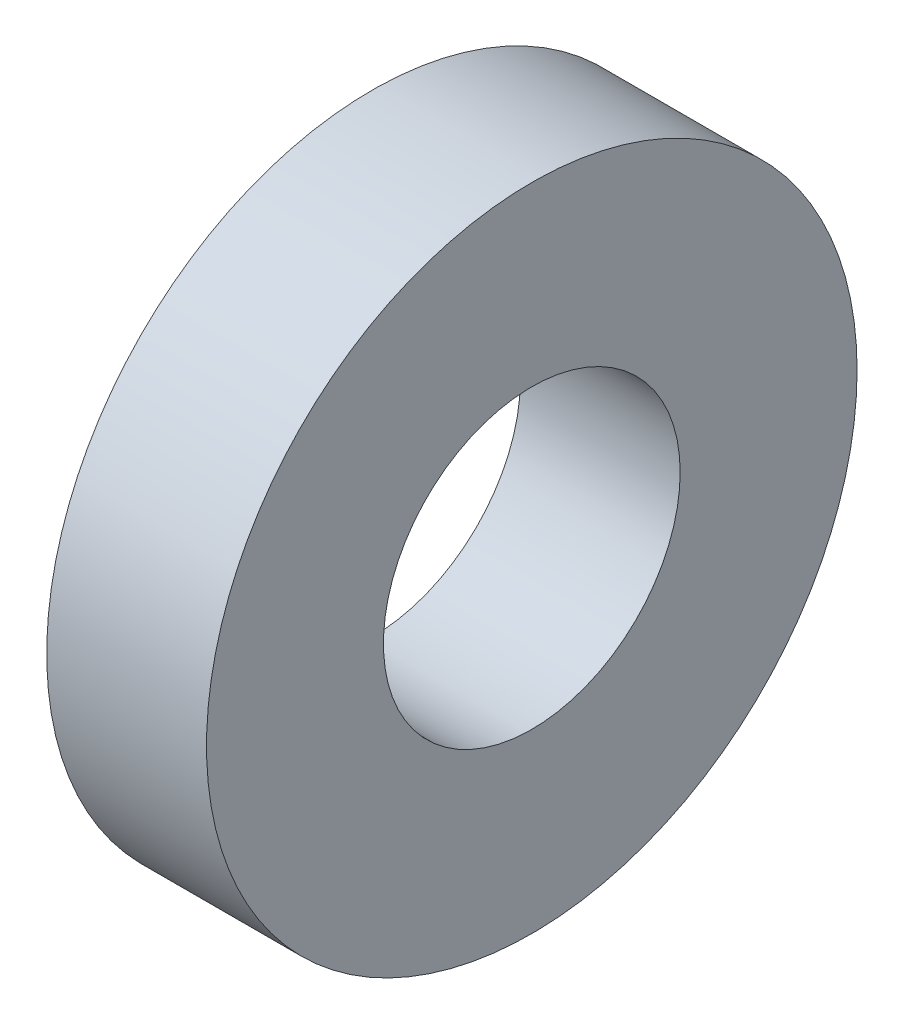
ISO-10303-21;
HEADER;
FILE_DESCRIPTION(('STEP AP214'),'2;1');
FILE_NAME('part.step','',(''),(''),'','','');
FILE_SCHEMA(('AUTOMOTIVE_DESIGN { 1 0 10303 214 1 1 1 1 }'));
ENDSEC;
DATA;
#1=APPLICATION_CONTEXT('core data for automotive mechanical design processes');
#2=APPLICATION_PROTOCOL_DEFINITION('international standard','automotive_design',2000,#1);
#3=PRODUCT_CONTEXT('',#1,'mechanical');
#4=PRODUCT('Part','Part','',(#3));
#5=PRODUCT_RELATED_PRODUCT_CATEGORY('part','',(#4));
#6=PRODUCT_DEFINITION_FORMATION('','',#4);
#7=PRODUCT_DEFINITION_CONTEXT('part definition',#1,'design');
#8=PRODUCT_DEFINITION('design','',#6,#7);
#9=PRODUCT_DEFINITION_SHAPE('','',#8);
#10=(LENGTH_UNIT() NAMED_UNIT(*) SI_UNIT(.MILLI.,.METRE.));
#11=(NAMED_UNIT(*) PLANE_ANGLE_UNIT() SI_UNIT($,.RADIAN.));
#12=(NAMED_UNIT(*) SI_UNIT($,.STERADIAN.) SOLID_ANGLE_UNIT());
#13=UNCERTAINTY_MEASURE_WITH_UNIT(LENGTH_MEASURE(1.E-05),#10,'distance_accuracy_value','');
#14=(GEOMETRIC_REPRESENTATION_CONTEXT(3) GLOBAL_UNCERTAINTY_ASSIGNED_CONTEXT((#13)) GLOBAL_UNIT_ASSIGNED_CONTEXT((#10,
#11,#12)) REPRESENTATION_CONTEXT('',''));
#15=CARTESIAN_POINT('',(0.,0.,0.));
#16=DIRECTION('',(0.,0.,1.));
#17=DIRECTION('',(1.,0.,0.));
#18=AXIS2_PLACEMENT_3D('',#15,#16,#17);
#19=CARTESIAN_POINT('',(1.778,0.,0.));
#20=DIRECTION('',(1.,0.,0.));
#21=DIRECTION('',(0.,0.,-1.));
#22=AXIS2_PLACEMENT_3D('',#19,#20,#21);
#23=PLANE('',#22);
#24=CARTESIAN_POINT('',(1.778,0.,0.));
#25=DIRECTION('',(1.,0.,0.));
#26=DIRECTION('',(0.,0.,-1.));
#27=AXIS2_PLACEMENT_3D('',#24,#25,#26);
#28=CIRCLE('',#27,3.6195);
#29=CARTESIAN_POINT('',(1.778,0.,-3.6195));
#30=VERTEX_POINT('',#29);
#31=EDGE_CURVE('E10',#30,#30,#28,.T.);
#32=ORIENTED_EDGE('',*,*,#31,.T.);
#33=EDGE_LOOP('',(#32));
#34=FACE_BOUND('',#33,.T.);
#35=CARTESIAN_POINT('',(1.778,0.,0.));
#36=DIRECTION('',(1.,0.,0.));
#37=DIRECTION('',(0.,0.,-1.));
#38=AXIS2_PLACEMENT_3D('',#35,#36,#37);
#39=CIRCLE('',#38,1.651);
#40=CARTESIAN_POINT('',(1.778,0.,-1.651));
#41=VERTEX_POINT('',#40);
#42=EDGE_CURVE('E41',#41,#41,#39,.T.);
#43=ORIENTED_EDGE('',*,*,#42,.F.);
#44=EDGE_LOOP('',(#43));
#45=FACE_BOUND('',#44,.T.);
#46=ADVANCED_FACE('F30',(#34,#45),#23,.T.);
#47=CARTESIAN_POINT('',(0.,0.,0.));
#48=DIRECTION('',(1.,0.,0.));
#49=DIRECTION('',(0.,0.,-1.));
#50=AXIS2_PLACEMENT_3D('',#47,#48,#49);
#51=PLANE('',#50);
#52=CARTESIAN_POINT('',(0.,0.,0.));
#53=DIRECTION('',(1.,0.,0.));
#54=DIRECTION('',(0.,0.,-1.));
#55=AXIS2_PLACEMENT_3D('',#52,#53,#54);
#56=CIRCLE('',#55,3.6195);
#57=CARTESIAN_POINT('',(0.,0.,-3.6195));
#58=VERTEX_POINT('',#57);
#59=EDGE_CURVE('E34',#58,#58,#56,.T.);
#60=ORIENTED_EDGE('',*,*,#59,.F.);
#61=EDGE_LOOP('',(#60));
#62=FACE_BOUND('',#61,.T.);
#63=CARTESIAN_POINT('',(0.,0.,0.));
#64=DIRECTION('',(1.,0.,0.));
#65=DIRECTION('',(0.,0.,-1.));
#66=AXIS2_PLACEMENT_3D('',#63,#64,#65);
#67=CIRCLE('',#66,1.651);
#68=CARTESIAN_POINT('',(0.,0.,-1.651));
#69=VERTEX_POINT('',#68);
#70=EDGE_CURVE('E43',#69,#69,#67,.T.);
#71=ORIENTED_EDGE('',*,*,#70,.T.);
#72=EDGE_LOOP('',(#71));
#73=FACE_BOUND('',#72,.T.);
#74=ADVANCED_FACE('F53',(#62,#73),#51,.F.);
#75=CARTESIAN_POINT('',(1.778,0.,0.));
#76=DIRECTION('',(-1.,0.,0.));
#77=DIRECTION('',(0.,0.,1.));
#78=AXIS2_PLACEMENT_3D('',#75,#76,#77);
#79=CYLINDRICAL_SURFACE('',#78,3.6195);
#80=ORIENTED_EDGE('',*,*,#31,.F.);
#81=EDGE_LOOP('',(#80));
#82=FACE_BOUND('',#81,.T.);
#83=ORIENTED_EDGE('',*,*,#59,.T.);
#84=EDGE_LOOP('',(#83));
#85=FACE_BOUND('',#84,.T.);
#86=ADVANCED_FACE('F32',(#82,#85),#79,.T.);
#87=CARTESIAN_POINT('',(1.778,0.,0.));
#88=DIRECTION('',(-1.,0.,0.));
#89=DIRECTION('',(0.,0.,1.));
#90=AXIS2_PLACEMENT_3D('',#87,#88,#89);
#91=CYLINDRICAL_SURFACE('',#90,1.651);
#92=ORIENTED_EDGE('',*,*,#42,.T.);
#93=EDGE_LOOP('',(#92));
#94=FACE_BOUND('',#93,.T.);
#95=ORIENTED_EDGE('',*,*,#70,.F.);
#96=EDGE_LOOP('',(#95));
#97=FACE_BOUND('',#96,.T.);
#98=ADVANCED_FACE('F49',(#94,#97),#91,.F.);
#99=CLOSED_SHELL('',(#46,#74,#86,#98));
#100=MANIFOLD_SOLID_BREP('B2',#99);
#101=ADVANCED_BREP_SHAPE_REPRESENTATION('',(#18,#100),#14);
#102=SHAPE_DEFINITION_REPRESENTATION(#9,#101);
ENDSEC;
END-ISO-10303-21;
